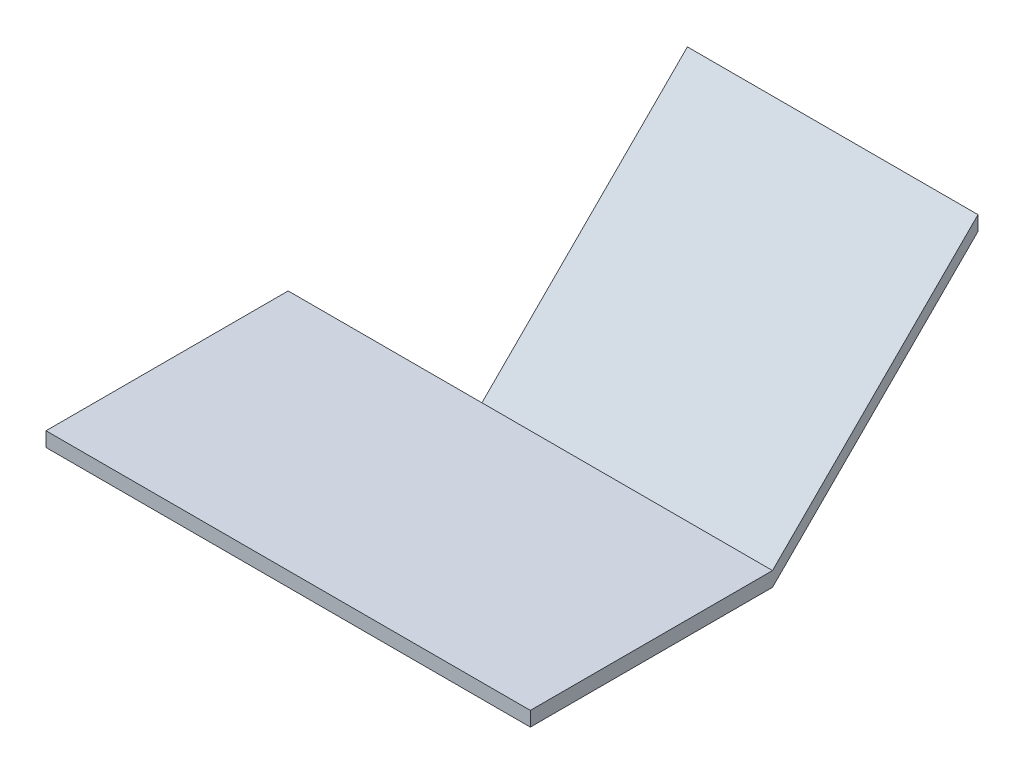
ISO-10303-21;
HEADER;
FILE_DESCRIPTION(('STEP AP214'),'2;1');
FILE_NAME('part.step','',(''),(''),'','','');
FILE_SCHEMA(('AUTOMOTIVE_DESIGN { 1 0 10303 214 1 1 1 1 }'));
ENDSEC;
DATA;
#1=APPLICATION_CONTEXT('core data for automotive mechanical design processes');
#2=APPLICATION_PROTOCOL_DEFINITION('international standard','automotive_design',2000,#1);
#3=PRODUCT_CONTEXT('',#1,'mechanical');
#4=PRODUCT('Part','Part','',(#3));
#5=PRODUCT_RELATED_PRODUCT_CATEGORY('part','',(#4));
#6=PRODUCT_DEFINITION_FORMATION('','',#4);
#7=PRODUCT_DEFINITION_CONTEXT('part definition',#1,'design');
#8=PRODUCT_DEFINITION('design','',#6,#7);
#9=PRODUCT_DEFINITION_SHAPE('','',#8);
#10=(LENGTH_UNIT() NAMED_UNIT(*) SI_UNIT(.MILLI.,.METRE.));
#11=(NAMED_UNIT(*) PLANE_ANGLE_UNIT() SI_UNIT($,.RADIAN.));
#12=(NAMED_UNIT(*) SI_UNIT($,.STERADIAN.) SOLID_ANGLE_UNIT());
#13=UNCERTAINTY_MEASURE_WITH_UNIT(LENGTH_MEASURE(1.E-05),#10,'distance_accuracy_value','');
#14=(GEOMETRIC_REPRESENTATION_CONTEXT(3) GLOBAL_UNCERTAINTY_ASSIGNED_CONTEXT((#13)) GLOBAL_UNIT_ASSIGNED_CONTEXT((#10,
#11,#12)) REPRESENTATION_CONTEXT('',''));
#15=CARTESIAN_POINT('',(0.,0.,0.));
#16=DIRECTION('',(0.,0.,1.));
#17=DIRECTION('',(1.,0.,0.));
#18=AXIS2_PLACEMENT_3D('',#15,#16,#17);
#19=CARTESIAN_POINT('',(-50.,-3.,-25.));
#20=DIRECTION('',(0.,0.,-1.));
#21=DIRECTION('',(-1.,0.,0.));
#22=AXIS2_PLACEMENT_3D('',#19,#20,#21);
#23=PLANE('',#22);
#24=DIRECTION('',(-1.,0.,0.));
#25=VECTOR('',#24,1.);
#26=CARTESIAN_POINT('',(-50.,0.,-25.));
#27=LINE('',#26,#25);
#28=CARTESIAN_POINT('',(-10.,0.,-25.));
#29=VERTEX_POINT('',#28);
#30=CARTESIAN_POINT('',(-50.,0.,-25.));
#31=VERTEX_POINT('',#30);
#32=EDGE_CURVE('E144',#29,#31,#27,.T.);
#33=ORIENTED_EDGE('',*,*,#32,.F.);
#34=DIRECTION('',(0.,-1.,0.));
#35=VECTOR('',#34,1.);
#36=CARTESIAN_POINT('',(-10.,-3.,-25.));
#37=LINE('',#36,#35);
#38=CARTESIAN_POINT('',(-10.,-3.,-25.));
#39=VERTEX_POINT('',#38);
#40=EDGE_CURVE('E120',#29,#39,#37,.T.);
#41=ORIENTED_EDGE('',*,*,#40,.T.);
#42=DIRECTION('',(-1.,0.,0.));
#43=VECTOR('',#42,1.);
#44=CARTESIAN_POINT('',(-50.,-3.,-25.));
#45=LINE('',#44,#43);
#46=CARTESIAN_POINT('',(-50.,-3.,-25.));
#47=VERTEX_POINT('',#46);
#48=EDGE_CURVE('E79',#39,#47,#45,.T.);
#49=ORIENTED_EDGE('',*,*,#48,.T.);
#50=DIRECTION('',(0.,1.,0.));
#51=VECTOR('',#50,1.);
#52=CARTESIAN_POINT('',(-50.,-3.,-25.));
#53=LINE('',#52,#51);
#54=EDGE_CURVE('E37',#47,#31,#53,.T.);
#55=ORIENTED_EDGE('',*,*,#54,.T.);
#56=EDGE_LOOP('',(#33,#41,#49,#55));
#57=FACE_BOUND('',#56,.T.);
#58=ADVANCED_FACE('F33',(#57),#23,.T.);
#59=CARTESIAN_POINT('',(50.,-3.,25.));
#60=DIRECTION('',(1.,0.,0.));
#61=DIRECTION('',(0.,0.,-1.));
#62=AXIS2_PLACEMENT_3D('',#59,#60,#61);
#63=PLANE('',#62);
#64=DIRECTION('',(0.,0.,-1.));
#65=VECTOR('',#64,1.);
#66=CARTESIAN_POINT('',(50.,0.,25.));
#67=LINE('',#66,#65);
#68=CARTESIAN_POINT('',(50.,0.,25.));
#69=VERTEX_POINT('',#68);
#70=CARTESIAN_POINT('',(50.,0.,-25.));
#71=VERTEX_POINT('',#70);
#72=EDGE_CURVE('E131',#69,#71,#67,.T.);
#73=ORIENTED_EDGE('',*,*,#72,.F.);
#74=DIRECTION('',(0.,1.,0.));
#75=VECTOR('',#74,1.);
#76=CARTESIAN_POINT('',(50.,-3.,25.));
#77=LINE('',#76,#75);
#78=CARTESIAN_POINT('',(50.,-3.,25.));
#79=VERTEX_POINT('',#78);
#80=EDGE_CURVE('E11',#79,#69,#77,.T.);
#81=ORIENTED_EDGE('',*,*,#80,.F.);
#82=DIRECTION('',(0.,0.,-1.));
#83=VECTOR('',#82,1.);
#84=CARTESIAN_POINT('',(50.,-3.,25.));
#85=LINE('',#84,#83);
#86=CARTESIAN_POINT('',(50.,-3.,-25.));
#87=VERTEX_POINT('',#86);
#88=EDGE_CURVE('E133',#79,#87,#85,.T.);
#89=ORIENTED_EDGE('',*,*,#88,.T.);
#90=DIRECTION('',(0.,0.707106781186544,-0.707106781186551));
#91=VECTOR('',#90,1.);
#92=CARTESIAN_POINT('',(50.,39.4264068711926,-67.4264068711931));
#93=LINE('',#92,#91);
#94=CARTESIAN_POINT('',(50.,39.4264068711926,-67.4264068711931));
#95=VERTEX_POINT('',#94);
#96=EDGE_CURVE('E126',#87,#95,#93,.T.);
#97=ORIENTED_EDGE('',*,*,#96,.T.);
#98=DIRECTION('',(0.,1.,0.));
#99=VECTOR('',#98,1.);
#100=CARTESIAN_POINT('',(50.,42.4264068711926,-67.4264068711931));
#101=LINE('',#100,#99);
#102=CARTESIAN_POINT('',(50.,42.4264068711926,-67.4264068711931));
#103=VERTEX_POINT('',#102);
#104=EDGE_CURVE('E108',#95,#103,#101,.T.);
#105=ORIENTED_EDGE('',*,*,#104,.T.);
#106=DIRECTION('',(0.,-0.707106781186544,0.707106781186551));
#107=VECTOR('',#106,1.);
#108=CARTESIAN_POINT('',(50.,0.,-25.));
#109=LINE('',#108,#107);
#110=EDGE_CURVE('E122',#103,#71,#109,.T.);
#111=ORIENTED_EDGE('',*,*,#110,.T.);
#112=EDGE_LOOP('',(#73,#81,#89,#97,#105,#111));
#113=FACE_BOUND('',#112,.T.);
#114=ADVANCED_FACE('F35',(#113),#63,.T.);
#115=CARTESIAN_POINT('',(-50.,-3.,25.));
#116=DIRECTION('',(0.,0.,1.));
#117=DIRECTION('',(1.,0.,0.));
#118=AXIS2_PLACEMENT_3D('',#115,#116,#117);
#119=PLANE('',#118);
#120=DIRECTION('',(1.,0.,0.));
#121=VECTOR('',#120,1.);
#122=CARTESIAN_POINT('',(-50.,0.,25.));
#123=LINE('',#122,#121);
#124=CARTESIAN_POINT('',(-50.,0.,25.));
#125=VERTEX_POINT('',#124);
#126=EDGE_CURVE('E135',#125,#69,#123,.T.);
#127=ORIENTED_EDGE('',*,*,#126,.F.);
#128=DIRECTION('',(0.,1.,0.));
#129=VECTOR('',#128,1.);
#130=CARTESIAN_POINT('',(-50.,-3.,25.));
#131=LINE('',#130,#129);
#132=CARTESIAN_POINT('',(-50.,-3.,25.));
#133=VERTEX_POINT('',#132);
#134=EDGE_CURVE('E42',#133,#125,#131,.T.);
#135=ORIENTED_EDGE('',*,*,#134,.F.);
#136=DIRECTION('',(1.,0.,0.));
#137=VECTOR('',#136,1.);
#138=CARTESIAN_POINT('',(-50.,-3.,25.));
#139=LINE('',#138,#137);
#140=EDGE_CURVE('E140',#133,#79,#139,.T.);
#141=ORIENTED_EDGE('',*,*,#140,.T.);
#142=ORIENTED_EDGE('',*,*,#80,.T.);
#143=EDGE_LOOP('',(#127,#135,#141,#142));
#144=FACE_BOUND('',#143,.T.);
#145=ADVANCED_FACE('F159',(#144),#119,.T.);
#146=CARTESIAN_POINT('',(-50.,-3.,25.));
#147=DIRECTION('',(-1.,0.,0.));
#148=DIRECTION('',(0.,0.,1.));
#149=AXIS2_PLACEMENT_3D('',#146,#147,#148);
#150=PLANE('',#149);
#151=DIRECTION('',(0.,0.,1.));
#152=VECTOR('',#151,1.);
#153=CARTESIAN_POINT('',(-50.,0.,25.));
#154=LINE('',#153,#152);
#155=EDGE_CURVE('E148',#31,#125,#154,.T.);
#156=ORIENTED_EDGE('',*,*,#155,.F.);
#157=ORIENTED_EDGE('',*,*,#54,.F.);
#158=DIRECTION('',(0.,0.,1.));
#159=VECTOR('',#158,1.);
#160=CARTESIAN_POINT('',(-50.,-3.,25.));
#161=LINE('',#160,#159);
#162=EDGE_CURVE('E137',#47,#133,#161,.T.);
#163=ORIENTED_EDGE('',*,*,#162,.T.);
#164=ORIENTED_EDGE('',*,*,#134,.T.);
#165=EDGE_LOOP('',(#156,#157,#163,#164));
#166=FACE_BOUND('',#165,.T.);
#167=ADVANCED_FACE('F156',(#166),#150,.T.);
#168=CARTESIAN_POINT('',(0.,-3.,0.));
#169=DIRECTION('',(0.,-1.,0.));
#170=DIRECTION('',(0.,0.,-1.));
#171=AXIS2_PLACEMENT_3D('',#168,#169,#170);
#172=PLANE('',#171);
#173=ORIENTED_EDGE('',*,*,#88,.F.);
#174=ORIENTED_EDGE('',*,*,#140,.F.);
#175=ORIENTED_EDGE('',*,*,#162,.F.);
#176=ORIENTED_EDGE('',*,*,#48,.F.);
#177=EDGE_CURVE('E119',#87,#39,#45,.T.);
#178=ORIENTED_EDGE('',*,*,#177,.F.);
#179=EDGE_LOOP('',(#173,#174,#175,#176,#178));
#180=FACE_BOUND('',#179,.T.);
#181=ADVANCED_FACE('F162',(#180),#172,.T.);
#182=CARTESIAN_POINT('',(0.,0.,0.));
#183=DIRECTION('',(0.,-1.,0.));
#184=DIRECTION('',(0.,0.,-1.));
#185=AXIS2_PLACEMENT_3D('',#182,#183,#184);
#186=PLANE('',#185);
#187=ORIENTED_EDGE('',*,*,#72,.T.);
#188=EDGE_CURVE('E145',#71,#29,#27,.T.);
#189=ORIENTED_EDGE('',*,*,#188,.T.);
#190=ORIENTED_EDGE('',*,*,#32,.T.);
#191=ORIENTED_EDGE('',*,*,#155,.T.);
#192=ORIENTED_EDGE('',*,*,#126,.T.);
#193=EDGE_LOOP('',(#187,#189,#190,#191,#192));
#194=FACE_BOUND('',#193,.T.);
#195=ADVANCED_FACE('F158',(#194),#186,.F.);
#196=CARTESIAN_POINT('',(-10.,0.,-25.));
#197=DIRECTION('',(0.,0.707106781186551,0.707106781186544));
#198=DIRECTION('',(0.,-0.707106781186544,0.707106781186551));
#199=AXIS2_PLACEMENT_3D('',#196,#197,#198);
#200=PLANE('',#199);
#201=ORIENTED_EDGE('',*,*,#110,.F.);
#202=DIRECTION('',(1.,0.,0.));
#203=VECTOR('',#202,1.);
#204=CARTESIAN_POINT('',(-10.,42.4264068711926,-67.4264068711931));
#205=LINE('',#204,#203);
#206=CARTESIAN_POINT('',(-10.,42.4264068711926,-67.4264068711931));
#207=VERTEX_POINT('',#206);
#208=EDGE_CURVE('E111',#207,#103,#205,.T.);
#209=ORIENTED_EDGE('',*,*,#208,.F.);
#210=DIRECTION('',(0.,-0.707106781186544,0.707106781186551));
#211=VECTOR('',#210,1.);
#212=CARTESIAN_POINT('',(-10.,0.,-25.));
#213=LINE('',#212,#211);
#214=EDGE_CURVE('E112',#207,#29,#213,.T.);
#215=ORIENTED_EDGE('',*,*,#214,.T.);
#216=ORIENTED_EDGE('',*,*,#188,.F.);
#217=EDGE_LOOP('',(#201,#209,#215,#216));
#218=FACE_BOUND('',#217,.T.);
#219=ADVANCED_FACE('F165',(#218),#200,.T.);
#220=CARTESIAN_POINT('',(-10.,42.4264068711926,-67.4264068711931));
#221=DIRECTION('',(0.,0.,-1.));
#222=DIRECTION('',(0.,1.,0.));
#223=AXIS2_PLACEMENT_3D('',#220,#221,#222);
#224=PLANE('',#223);
#225=ORIENTED_EDGE('',*,*,#104,.F.);
#226=DIRECTION('',(1.,0.,0.));
#227=VECTOR('',#226,1.);
#228=CARTESIAN_POINT('',(-10.,39.4264068711926,-67.4264068711931));
#229=LINE('',#228,#227);
#230=CARTESIAN_POINT('',(-10.,39.4264068711926,-67.4264068711931));
#231=VERTEX_POINT('',#230);
#232=EDGE_CURVE('E103',#231,#95,#229,.T.);
#233=ORIENTED_EDGE('',*,*,#232,.F.);
#234=DIRECTION('',(0.,1.,0.));
#235=VECTOR('',#234,1.);
#236=CARTESIAN_POINT('',(-10.,42.4264068711926,-67.4264068711931));
#237=LINE('',#236,#235);
#238=EDGE_CURVE('E105',#231,#207,#237,.T.);
#239=ORIENTED_EDGE('',*,*,#238,.T.);
#240=ORIENTED_EDGE('',*,*,#208,.T.);
#241=EDGE_LOOP('',(#225,#233,#239,#240));
#242=FACE_BOUND('',#241,.T.);
#243=ADVANCED_FACE('F104',(#242),#224,.T.);
#244=CARTESIAN_POINT('',(-10.,39.4264068711926,-67.4264068711931));
#245=DIRECTION('',(0.,-0.707106781186551,-0.707106781186544));
#246=DIRECTION('',(0.,0.707106781186544,-0.707106781186551));
#247=AXIS2_PLACEMENT_3D('',#244,#245,#246);
#248=PLANE('',#247);
#249=ORIENTED_EDGE('',*,*,#96,.F.);
#250=ORIENTED_EDGE('',*,*,#177,.T.);
#251=DIRECTION('',(0.,0.707106781186544,-0.707106781186551));
#252=VECTOR('',#251,1.);
#253=CARTESIAN_POINT('',(-10.,39.4264068711926,-67.4264068711931));
#254=LINE('',#253,#252);
#255=EDGE_CURVE('E50',#39,#231,#254,.T.);
#256=ORIENTED_EDGE('',*,*,#255,.T.);
#257=ORIENTED_EDGE('',*,*,#232,.T.);
#258=EDGE_LOOP('',(#249,#250,#256,#257));
#259=FACE_BOUND('',#258,.T.);
#260=ADVANCED_FACE('F117',(#259),#248,.T.);
#261=CARTESIAN_POINT('',(-10.,0.,0.));
#262=DIRECTION('',(-1.,0.,0.));
#263=DIRECTION('',(0.,0.,1.));
#264=AXIS2_PLACEMENT_3D('',#261,#262,#263);
#265=PLANE('',#264);
#266=ORIENTED_EDGE('',*,*,#40,.F.);
#267=ORIENTED_EDGE('',*,*,#214,.F.);
#268=ORIENTED_EDGE('',*,*,#238,.F.);
#269=ORIENTED_EDGE('',*,*,#255,.F.);
#270=EDGE_LOOP('',(#266,#267,#268,#269));
#271=FACE_BOUND('',#270,.T.);
#272=ADVANCED_FACE('F114',(#271),#265,.T.);
#273=CLOSED_SHELL('',(#58,#114,#145,#167,#181,#195,#219,#243,#260,#272));
#274=MANIFOLD_SOLID_BREP('B2',#273);
#275=ADVANCED_BREP_SHAPE_REPRESENTATION('',(#18,#274),#14);
#276=SHAPE_DEFINITION_REPRESENTATION(#9,#275);
ENDSEC;
END-ISO-10303-21;
